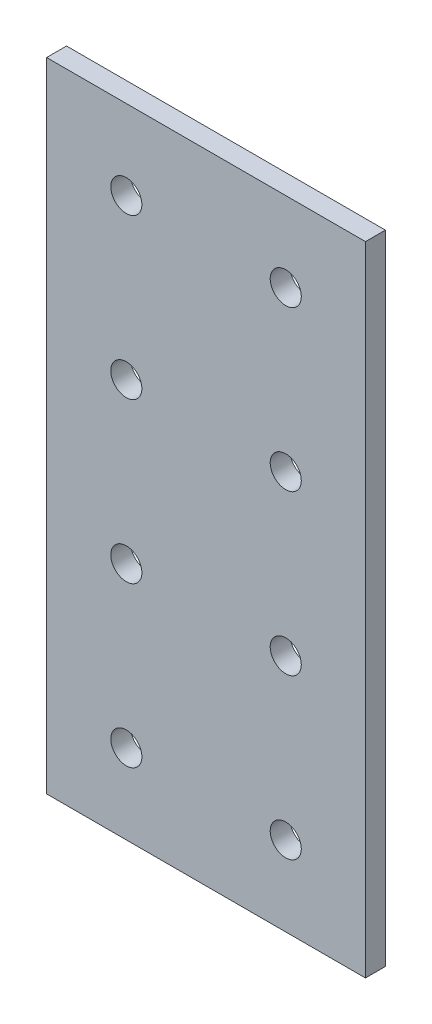
ISO-10303-21;
HEADER;
FILE_DESCRIPTION(('STEP AP214'),'2;1');
FILE_NAME('part.step','',(''),(''),'','','');
FILE_SCHEMA(('AUTOMOTIVE_DESIGN { 1 0 10303 214 1 1 1 1 }'));
ENDSEC;
DATA;
#1=APPLICATION_CONTEXT('core data for automotive mechanical design processes');
#2=APPLICATION_PROTOCOL_DEFINITION('international standard','automotive_design',2000,#1);
#3=PRODUCT_CONTEXT('',#1,'mechanical');
#4=PRODUCT('Part','Part','',(#3));
#5=PRODUCT_RELATED_PRODUCT_CATEGORY('part','',(#4));
#6=PRODUCT_DEFINITION_FORMATION('','',#4);
#7=PRODUCT_DEFINITION_CONTEXT('part definition',#1,'design');
#8=PRODUCT_DEFINITION('design','',#6,#7);
#9=PRODUCT_DEFINITION_SHAPE('','',#8);
#10=(LENGTH_UNIT() NAMED_UNIT(*) SI_UNIT(.MILLI.,.METRE.));
#11=(NAMED_UNIT(*) PLANE_ANGLE_UNIT() SI_UNIT($,.RADIAN.));
#12=(NAMED_UNIT(*) SI_UNIT($,.STERADIAN.) SOLID_ANGLE_UNIT());
#13=UNCERTAINTY_MEASURE_WITH_UNIT(LENGTH_MEASURE(1.E-05),#10,'distance_accuracy_value','');
#14=(GEOMETRIC_REPRESENTATION_CONTEXT(3) GLOBAL_UNCERTAINTY_ASSIGNED_CONTEXT((#13)) GLOBAL_UNIT_ASSIGNED_CONTEXT((#10,
#11,#12)) REPRESENTATION_CONTEXT('',''));
#15=CARTESIAN_POINT('',(0.,0.,0.));
#16=DIRECTION('',(0.,0.,1.));
#17=DIRECTION('',(1.,0.,0.));
#18=AXIS2_PLACEMENT_3D('',#15,#16,#17);
#19=CARTESIAN_POINT('',(0.,0.,3.175));
#20=DIRECTION('',(0.,0.,-1.));
#21=DIRECTION('',(-1.,0.,0.));
#22=AXIS2_PLACEMENT_3D('',#19,#20,#21);
#23=PLANE('',#22);
#24=DIRECTION('',(1.,0.,0.));
#25=VECTOR('',#24,1.);
#26=CARTESIAN_POINT('',(-25.4,0.,3.175));
#27=LINE('',#26,#25);
#28=CARTESIAN_POINT('',(-25.4,0.,3.175));
#29=VERTEX_POINT('',#28);
#30=CARTESIAN_POINT('',(25.4,0.,3.175));
#31=VERTEX_POINT('',#30);
#32=EDGE_CURVE('E75',#29,#31,#27,.T.);
#33=ORIENTED_EDGE('',*,*,#32,.T.);
#34=DIRECTION('',(0.,1.,0.));
#35=VECTOR('',#34,1.);
#36=CARTESIAN_POINT('',(25.4,50.8,3.175));
#37=LINE('',#36,#35);
#38=CARTESIAN_POINT('',(25.4,101.6,3.175));
#39=VERTEX_POINT('',#38);
#40=EDGE_CURVE('E78',#31,#39,#37,.T.);
#41=ORIENTED_EDGE('',*,*,#40,.T.);
#42=DIRECTION('',(-1.,0.,0.));
#43=VECTOR('',#42,1.);
#44=CARTESIAN_POINT('',(25.4,101.6,3.175));
#45=LINE('',#44,#43);
#46=CARTESIAN_POINT('',(-25.4,101.6,3.175));
#47=VERTEX_POINT('',#46);
#48=EDGE_CURVE('E82',#39,#47,#45,.T.);
#49=ORIENTED_EDGE('',*,*,#48,.T.);
#50=DIRECTION('',(0.,-1.,0.));
#51=VECTOR('',#50,1.);
#52=CARTESIAN_POINT('',(-25.4,101.6,3.175));
#53=LINE('',#52,#51);
#54=EDGE_CURVE('E50',#47,#29,#53,.T.);
#55=ORIENTED_EDGE('',*,*,#54,.T.);
#56=EDGE_LOOP('',(#33,#41,#49,#55));
#57=FACE_BOUND('',#56,.T.);
#58=CARTESIAN_POINT('',(-12.7,88.8999999999999,3.175));
#59=DIRECTION('',(0.,0.,1.));
#60=DIRECTION('',(1.,0.,0.));
#61=AXIS2_PLACEMENT_3D('',#58,#59,#60);
#62=CIRCLE('',#61,2.4765);
#63=CARTESIAN_POINT('',(-10.2235,88.8999999999999,3.175));
#64=VERTEX_POINT('',#63);
#65=EDGE_CURVE('E99',#64,#64,#62,.T.);
#66=ORIENTED_EDGE('',*,*,#65,.F.);
#67=EDGE_LOOP('',(#66));
#68=FACE_BOUND('',#67,.T.);
#69=CARTESIAN_POINT('',(12.7,88.8999999999999,3.175));
#70=DIRECTION('',(0.,0.,1.));
#71=DIRECTION('',(1.,0.,0.));
#72=AXIS2_PLACEMENT_3D('',#69,#70,#71);
#73=CIRCLE('',#72,2.4765);
#74=CARTESIAN_POINT('',(15.1765,88.8999999999999,3.175));
#75=VERTEX_POINT('',#74);
#76=EDGE_CURVE('E113',#75,#75,#73,.T.);
#77=ORIENTED_EDGE('',*,*,#76,.F.);
#78=EDGE_LOOP('',(#77));
#79=FACE_BOUND('',#78,.T.);
#80=CARTESIAN_POINT('',(-12.7,63.4999999999999,3.175));
#81=DIRECTION('',(0.,0.,1.));
#82=DIRECTION('',(1.,0.,0.));
#83=AXIS2_PLACEMENT_3D('',#80,#81,#82);
#84=CIRCLE('',#83,2.4765);
#85=CARTESIAN_POINT('',(-10.2235,63.4999999999999,3.175));
#86=VERTEX_POINT('',#85);
#87=EDGE_CURVE('E119',#86,#86,#84,.T.);
#88=ORIENTED_EDGE('',*,*,#87,.F.);
#89=EDGE_LOOP('',(#88));
#90=FACE_BOUND('',#89,.T.);
#91=CARTESIAN_POINT('',(12.7,63.4999999999999,3.175));
#92=DIRECTION('',(0.,0.,1.));
#93=DIRECTION('',(1.,0.,0.));
#94=AXIS2_PLACEMENT_3D('',#91,#92,#93);
#95=CIRCLE('',#94,2.4765);
#96=CARTESIAN_POINT('',(15.1765,63.4999999999999,3.175));
#97=VERTEX_POINT('',#96);
#98=EDGE_CURVE('E125',#97,#97,#95,.T.);
#99=ORIENTED_EDGE('',*,*,#98,.F.);
#100=EDGE_LOOP('',(#99));
#101=FACE_BOUND('',#100,.T.);
#102=CARTESIAN_POINT('',(12.7,12.7,3.175));
#103=DIRECTION('',(0.,0.,1.));
#104=DIRECTION('',(1.,0.,0.));
#105=AXIS2_PLACEMENT_3D('',#102,#103,#104);
#106=CIRCLE('',#105,2.4765);
#107=CARTESIAN_POINT('',(15.1765,12.7,3.175));
#108=VERTEX_POINT('',#107);
#109=EDGE_CURVE('E131',#108,#108,#106,.T.);
#110=ORIENTED_EDGE('',*,*,#109,.F.);
#111=EDGE_LOOP('',(#110));
#112=FACE_BOUND('',#111,.T.);
#113=CARTESIAN_POINT('',(-12.7,12.7,3.175));
#114=DIRECTION('',(0.,0.,1.));
#115=DIRECTION('',(1.,0.,0.));
#116=AXIS2_PLACEMENT_3D('',#113,#114,#115);
#117=CIRCLE('',#116,2.4765);
#118=CARTESIAN_POINT('',(-10.2235,12.7,3.175));
#119=VERTEX_POINT('',#118);
#120=EDGE_CURVE('E137',#119,#119,#117,.T.);
#121=ORIENTED_EDGE('',*,*,#120,.F.);
#122=EDGE_LOOP('',(#121));
#123=FACE_BOUND('',#122,.T.);
#124=CARTESIAN_POINT('',(-12.7,38.1,3.175));
#125=DIRECTION('',(0.,0.,1.));
#126=DIRECTION('',(1.,0.,0.));
#127=AXIS2_PLACEMENT_3D('',#124,#125,#126);
#128=CIRCLE('',#127,2.4765);
#129=CARTESIAN_POINT('',(-10.2235,38.1,3.175));
#130=VERTEX_POINT('',#129);
#131=EDGE_CURVE('E143',#130,#130,#128,.T.);
#132=ORIENTED_EDGE('',*,*,#131,.F.);
#133=EDGE_LOOP('',(#132));
#134=FACE_BOUND('',#133,.T.);
#135=CARTESIAN_POINT('',(12.7,38.1,3.175));
#136=DIRECTION('',(0.,0.,1.));
#137=DIRECTION('',(1.,0.,0.));
#138=AXIS2_PLACEMENT_3D('',#135,#136,#137);
#139=CIRCLE('',#138,2.4765);
#140=CARTESIAN_POINT('',(15.1765,38.1,3.175));
#141=VERTEX_POINT('',#140);
#142=EDGE_CURVE('E149',#141,#141,#139,.T.);
#143=ORIENTED_EDGE('',*,*,#142,.F.);
#144=EDGE_LOOP('',(#143));
#145=FACE_BOUND('',#144,.T.);
#146=ADVANCED_FACE('F33',(#57,#68,#79,#90,#101,#112,#123,#134,#145),#23,.F.);
#147=CARTESIAN_POINT('',(0.,0.,0.));
#148=DIRECTION('',(0.,0.,-1.));
#149=DIRECTION('',(-1.,0.,0.));
#150=AXIS2_PLACEMENT_3D('',#147,#148,#149);
#151=PLANE('',#150);
#152=CARTESIAN_POINT('',(-12.7,38.1,0.));
#153=DIRECTION('',(0.,0.,1.));
#154=DIRECTION('',(1.,0.,0.));
#155=AXIS2_PLACEMENT_3D('',#152,#153,#154);
#156=CIRCLE('',#155,2.4765);
#157=CARTESIAN_POINT('',(-10.2235,38.1,0.));
#158=VERTEX_POINT('',#157);
#159=EDGE_CURVE('E146',#158,#158,#156,.T.);
#160=ORIENTED_EDGE('',*,*,#159,.T.);
#161=EDGE_LOOP('',(#160));
#162=FACE_BOUND('',#161,.T.);
#163=CARTESIAN_POINT('',(12.7,12.7,0.));
#164=DIRECTION('',(0.,0.,1.));
#165=DIRECTION('',(1.,0.,0.));
#166=AXIS2_PLACEMENT_3D('',#163,#164,#165);
#167=CIRCLE('',#166,2.4765);
#168=CARTESIAN_POINT('',(15.1765,12.7,0.));
#169=VERTEX_POINT('',#168);
#170=EDGE_CURVE('E134',#169,#169,#167,.T.);
#171=ORIENTED_EDGE('',*,*,#170,.T.);
#172=EDGE_LOOP('',(#171));
#173=FACE_BOUND('',#172,.T.);
#174=CARTESIAN_POINT('',(-12.7,63.4999999999999,0.));
#175=DIRECTION('',(0.,0.,1.));
#176=DIRECTION('',(1.,0.,0.));
#177=AXIS2_PLACEMENT_3D('',#174,#175,#176);
#178=CIRCLE('',#177,2.4765);
#179=CARTESIAN_POINT('',(-10.2235,63.4999999999999,0.));
#180=VERTEX_POINT('',#179);
#181=EDGE_CURVE('E122',#180,#180,#178,.T.);
#182=ORIENTED_EDGE('',*,*,#181,.T.);
#183=EDGE_LOOP('',(#182));
#184=FACE_BOUND('',#183,.T.);
#185=CARTESIAN_POINT('',(-12.7,88.8999999999999,0.));
#186=DIRECTION('',(0.,0.,1.));
#187=DIRECTION('',(1.,0.,0.));
#188=AXIS2_PLACEMENT_3D('',#185,#186,#187);
#189=CIRCLE('',#188,2.4765);
#190=CARTESIAN_POINT('',(-10.2235,88.8999999999999,0.));
#191=VERTEX_POINT('',#190);
#192=EDGE_CURVE('E110',#191,#191,#189,.T.);
#193=ORIENTED_EDGE('',*,*,#192,.T.);
#194=EDGE_LOOP('',(#193));
#195=FACE_BOUND('',#194,.T.);
#196=DIRECTION('',(1.,0.,0.));
#197=VECTOR('',#196,1.);
#198=CARTESIAN_POINT('',(0.,0.,0.));
#199=LINE('',#198,#197);
#200=CARTESIAN_POINT('',(-25.4,0.,0.));
#201=VERTEX_POINT('',#200);
#202=CARTESIAN_POINT('',(25.4,0.,0.));
#203=VERTEX_POINT('',#202);
#204=EDGE_CURVE('E71',#201,#203,#199,.T.);
#205=ORIENTED_EDGE('',*,*,#204,.F.);
#206=DIRECTION('',(0.,-1.,0.));
#207=VECTOR('',#206,1.);
#208=CARTESIAN_POINT('',(-25.4,50.8,0.));
#209=LINE('',#208,#207);
#210=CARTESIAN_POINT('',(-25.4,101.6,0.));
#211=VERTEX_POINT('',#210);
#212=EDGE_CURVE('E67',#211,#201,#209,.T.);
#213=ORIENTED_EDGE('',*,*,#212,.F.);
#214=DIRECTION('',(-1.,0.,0.));
#215=VECTOR('',#214,1.);
#216=CARTESIAN_POINT('',(25.4,101.6,0.));
#217=LINE('',#216,#215);
#218=CARTESIAN_POINT('',(25.4,101.6,0.));
#219=VERTEX_POINT('',#218);
#220=EDGE_CURVE('E101',#219,#211,#217,.T.);
#221=ORIENTED_EDGE('',*,*,#220,.F.);
#222=DIRECTION('',(0.,1.,0.));
#223=VECTOR('',#222,1.);
#224=CARTESIAN_POINT('',(25.4,50.8,0.));
#225=LINE('',#224,#223);
#226=EDGE_CURVE('E88',#203,#219,#225,.T.);
#227=ORIENTED_EDGE('',*,*,#226,.F.);
#228=EDGE_LOOP('',(#205,#213,#221,#227));
#229=FACE_BOUND('',#228,.T.);
#230=CARTESIAN_POINT('',(12.7,88.8999999999999,0.));
#231=DIRECTION('',(0.,0.,1.));
#232=DIRECTION('',(1.,0.,0.));
#233=AXIS2_PLACEMENT_3D('',#230,#231,#232);
#234=CIRCLE('',#233,2.4765);
#235=CARTESIAN_POINT('',(15.1765,88.8999999999999,0.));
#236=VERTEX_POINT('',#235);
#237=EDGE_CURVE('E116',#236,#236,#234,.T.);
#238=ORIENTED_EDGE('',*,*,#237,.T.);
#239=EDGE_LOOP('',(#238));
#240=FACE_BOUND('',#239,.T.);
#241=CARTESIAN_POINT('',(12.7,63.4999999999999,0.));
#242=DIRECTION('',(0.,0.,1.));
#243=DIRECTION('',(1.,0.,0.));
#244=AXIS2_PLACEMENT_3D('',#241,#242,#243);
#245=CIRCLE('',#244,2.4765);
#246=CARTESIAN_POINT('',(15.1765,63.4999999999999,0.));
#247=VERTEX_POINT('',#246);
#248=EDGE_CURVE('E128',#247,#247,#245,.T.);
#249=ORIENTED_EDGE('',*,*,#248,.T.);
#250=EDGE_LOOP('',(#249));
#251=FACE_BOUND('',#250,.T.);
#252=CARTESIAN_POINT('',(-12.7,12.7,0.));
#253=DIRECTION('',(0.,0.,1.));
#254=DIRECTION('',(1.,0.,0.));
#255=AXIS2_PLACEMENT_3D('',#252,#253,#254);
#256=CIRCLE('',#255,2.4765);
#257=CARTESIAN_POINT('',(-10.2235,12.7,0.));
#258=VERTEX_POINT('',#257);
#259=EDGE_CURVE('E140',#258,#258,#256,.T.);
#260=ORIENTED_EDGE('',*,*,#259,.T.);
#261=EDGE_LOOP('',(#260));
#262=FACE_BOUND('',#261,.T.);
#263=CARTESIAN_POINT('',(12.7,38.1,0.));
#264=DIRECTION('',(0.,0.,1.));
#265=DIRECTION('',(1.,0.,0.));
#266=AXIS2_PLACEMENT_3D('',#263,#264,#265);
#267=CIRCLE('',#266,2.4765);
#268=CARTESIAN_POINT('',(15.1765,38.1,0.));
#269=VERTEX_POINT('',#268);
#270=EDGE_CURVE('E152',#269,#269,#267,.T.);
#271=ORIENTED_EDGE('',*,*,#270,.T.);
#272=EDGE_LOOP('',(#271));
#273=FACE_BOUND('',#272,.T.);
#274=ADVANCED_FACE('F162',(#162,#173,#184,#195,#229,#240,#251,#262,#273),#151,.T.);
#275=CARTESIAN_POINT('',(0.,0.,3.175));
#276=DIRECTION('',(0.,1.,0.));
#277=DIRECTION('',(0.,0.,1.));
#278=AXIS2_PLACEMENT_3D('',#275,#276,#277);
#279=PLANE('',#278);
#280=ORIENTED_EDGE('',*,*,#204,.T.);
#281=DIRECTION('',(0.,0.,-1.));
#282=VECTOR('',#281,1.);
#283=CARTESIAN_POINT('',(25.4,0.,3.175));
#284=LINE('',#283,#282);
#285=EDGE_CURVE('E11',#31,#203,#284,.T.);
#286=ORIENTED_EDGE('',*,*,#285,.F.);
#287=ORIENTED_EDGE('',*,*,#32,.F.);
#288=DIRECTION('',(0.,0.,-1.));
#289=VECTOR('',#288,1.);
#290=CARTESIAN_POINT('',(-25.4,0.,3.175));
#291=LINE('',#290,#289);
#292=EDGE_CURVE('E94',#29,#201,#291,.T.);
#293=ORIENTED_EDGE('',*,*,#292,.T.);
#294=EDGE_LOOP('',(#280,#286,#287,#293));
#295=FACE_BOUND('',#294,.T.);
#296=ADVANCED_FACE('F35',(#295),#279,.F.);
#297=CARTESIAN_POINT('',(25.4,50.8,3.175));
#298=DIRECTION('',(-1.,0.,0.));
#299=DIRECTION('',(0.,0.,1.));
#300=AXIS2_PLACEMENT_3D('',#297,#298,#299);
#301=PLANE('',#300);
#302=ORIENTED_EDGE('',*,*,#226,.T.);
#303=DIRECTION('',(0.,0.,-1.));
#304=VECTOR('',#303,1.);
#305=CARTESIAN_POINT('',(25.4,101.6,3.175));
#306=LINE('',#305,#304);
#307=EDGE_CURVE('E42',#39,#219,#306,.T.);
#308=ORIENTED_EDGE('',*,*,#307,.F.);
#309=ORIENTED_EDGE('',*,*,#40,.F.);
#310=ORIENTED_EDGE('',*,*,#285,.T.);
#311=EDGE_LOOP('',(#302,#308,#309,#310));
#312=FACE_BOUND('',#311,.T.);
#313=ADVANCED_FACE('F87',(#312),#301,.F.);
#314=CARTESIAN_POINT('',(25.4,101.6,3.175));
#315=DIRECTION('',(0.,-1.,0.));
#316=DIRECTION('',(0.,0.,-1.));
#317=AXIS2_PLACEMENT_3D('',#314,#315,#316);
#318=PLANE('',#317);
#319=ORIENTED_EDGE('',*,*,#220,.T.);
#320=DIRECTION('',(0.,0.,-1.));
#321=VECTOR('',#320,1.);
#322=CARTESIAN_POINT('',(-25.4,101.6,3.175));
#323=LINE('',#322,#321);
#324=EDGE_CURVE('E90',#47,#211,#323,.T.);
#325=ORIENTED_EDGE('',*,*,#324,.F.);
#326=ORIENTED_EDGE('',*,*,#48,.F.);
#327=ORIENTED_EDGE('',*,*,#307,.T.);
#328=EDGE_LOOP('',(#319,#325,#326,#327));
#329=FACE_BOUND('',#328,.T.);
#330=ADVANCED_FACE('F91',(#329),#318,.F.);
#331=CARTESIAN_POINT('',(-25.4,50.8,3.175));
#332=DIRECTION('',(1.,0.,0.));
#333=DIRECTION('',(0.,0.,-1.));
#334=AXIS2_PLACEMENT_3D('',#331,#332,#333);
#335=PLANE('',#334);
#336=ORIENTED_EDGE('',*,*,#212,.T.);
#337=ORIENTED_EDGE('',*,*,#292,.F.);
#338=ORIENTED_EDGE('',*,*,#54,.F.);
#339=ORIENTED_EDGE('',*,*,#324,.T.);
#340=EDGE_LOOP('',(#336,#337,#338,#339));
#341=FACE_BOUND('',#340,.T.);
#342=ADVANCED_FACE('F107',(#341),#335,.F.);
#343=CARTESIAN_POINT('',(-12.7,88.8999999999999,3.175));
#344=DIRECTION('',(0.,0.,-1.));
#345=DIRECTION('',(-1.,0.,0.));
#346=AXIS2_PLACEMENT_3D('',#343,#344,#345);
#347=CYLINDRICAL_SURFACE('',#346,2.4765);
#348=ORIENTED_EDGE('',*,*,#65,.T.);
#349=EDGE_LOOP('',(#348));
#350=FACE_BOUND('',#349,.T.);
#351=ORIENTED_EDGE('',*,*,#192,.F.);
#352=EDGE_LOOP('',(#351));
#353=FACE_BOUND('',#352,.T.);
#354=ADVANCED_FACE('F170',(#350,#353),#347,.F.);
#355=CARTESIAN_POINT('',(12.7,88.8999999999999,3.175));
#356=DIRECTION('',(0.,0.,-1.));
#357=DIRECTION('',(-1.,0.,0.));
#358=AXIS2_PLACEMENT_3D('',#355,#356,#357);
#359=CYLINDRICAL_SURFACE('',#358,2.4765);
#360=ORIENTED_EDGE('',*,*,#76,.T.);
#361=EDGE_LOOP('',(#360));
#362=FACE_BOUND('',#361,.T.);
#363=ORIENTED_EDGE('',*,*,#237,.F.);
#364=EDGE_LOOP('',(#363));
#365=FACE_BOUND('',#364,.T.);
#366=ADVANCED_FACE('F225',(#362,#365),#359,.F.);
#367=CARTESIAN_POINT('',(-12.7,63.4999999999999,3.175));
#368=DIRECTION('',(0.,0.,-1.));
#369=DIRECTION('',(-1.,0.,0.));
#370=AXIS2_PLACEMENT_3D('',#367,#368,#369);
#371=CYLINDRICAL_SURFACE('',#370,2.4765);
#372=ORIENTED_EDGE('',*,*,#87,.T.);
#373=EDGE_LOOP('',(#372));
#374=FACE_BOUND('',#373,.T.);
#375=ORIENTED_EDGE('',*,*,#181,.F.);
#376=EDGE_LOOP('',(#375));
#377=FACE_BOUND('',#376,.T.);
#378=ADVANCED_FACE('F233',(#374,#377),#371,.F.);
#379=CARTESIAN_POINT('',(12.7,63.4999999999999,3.175));
#380=DIRECTION('',(0.,0.,-1.));
#381=DIRECTION('',(-1.,0.,0.));
#382=AXIS2_PLACEMENT_3D('',#379,#380,#381);
#383=CYLINDRICAL_SURFACE('',#382,2.4765);
#384=ORIENTED_EDGE('',*,*,#98,.T.);
#385=EDGE_LOOP('',(#384));
#386=FACE_BOUND('',#385,.T.);
#387=ORIENTED_EDGE('',*,*,#248,.F.);
#388=EDGE_LOOP('',(#387));
#389=FACE_BOUND('',#388,.T.);
#390=ADVANCED_FACE('F241',(#386,#389),#383,.F.);
#391=CARTESIAN_POINT('',(12.7,12.7,3.175));
#392=DIRECTION('',(0.,0.,-1.));
#393=DIRECTION('',(-1.,0.,0.));
#394=AXIS2_PLACEMENT_3D('',#391,#392,#393);
#395=CYLINDRICAL_SURFACE('',#394,2.4765);
#396=ORIENTED_EDGE('',*,*,#109,.T.);
#397=EDGE_LOOP('',(#396));
#398=FACE_BOUND('',#397,.T.);
#399=ORIENTED_EDGE('',*,*,#170,.F.);
#400=EDGE_LOOP('',(#399));
#401=FACE_BOUND('',#400,.T.);
#402=ADVANCED_FACE('F250',(#398,#401),#395,.F.);
#403=CARTESIAN_POINT('',(-12.7,12.7,3.175));
#404=DIRECTION('',(0.,0.,-1.));
#405=DIRECTION('',(-1.,0.,0.));
#406=AXIS2_PLACEMENT_3D('',#403,#404,#405);
#407=CYLINDRICAL_SURFACE('',#406,2.4765);
#408=ORIENTED_EDGE('',*,*,#120,.T.);
#409=EDGE_LOOP('',(#408));
#410=FACE_BOUND('',#409,.T.);
#411=ORIENTED_EDGE('',*,*,#259,.F.);
#412=EDGE_LOOP('',(#411));
#413=FACE_BOUND('',#412,.T.);
#414=ADVANCED_FACE('F259',(#410,#413),#407,.F.);
#415=CARTESIAN_POINT('',(-12.7,38.1,3.175));
#416=DIRECTION('',(0.,0.,-1.));
#417=DIRECTION('',(-1.,0.,0.));
#418=AXIS2_PLACEMENT_3D('',#415,#416,#417);
#419=CYLINDRICAL_SURFACE('',#418,2.4765);
#420=ORIENTED_EDGE('',*,*,#131,.T.);
#421=EDGE_LOOP('',(#420));
#422=FACE_BOUND('',#421,.T.);
#423=ORIENTED_EDGE('',*,*,#159,.F.);
#424=EDGE_LOOP('',(#423));
#425=FACE_BOUND('',#424,.T.);
#426=ADVANCED_FACE('F268',(#422,#425),#419,.F.);
#427=CARTESIAN_POINT('',(12.7,38.1,3.175));
#428=DIRECTION('',(0.,0.,-1.));
#429=DIRECTION('',(-1.,0.,0.));
#430=AXIS2_PLACEMENT_3D('',#427,#428,#429);
#431=CYLINDRICAL_SURFACE('',#430,2.4765);
#432=ORIENTED_EDGE('',*,*,#142,.T.);
#433=EDGE_LOOP('',(#432));
#434=FACE_BOUND('',#433,.T.);
#435=ORIENTED_EDGE('',*,*,#270,.F.);
#436=EDGE_LOOP('',(#435));
#437=FACE_BOUND('',#436,.T.);
#438=ADVANCED_FACE('F158',(#434,#437),#431,.F.);
#439=CLOSED_SHELL('',(#146,#274,#296,#313,#330,#342,#354,#366,#378,#390,#402,#414,#426,#438));
#440=MANIFOLD_SOLID_BREP('B2',#439);
#441=ADVANCED_BREP_SHAPE_REPRESENTATION('',(#18,#440),#14);
#442=SHAPE_DEFINITION_REPRESENTATION(#9,#441);
ENDSEC;
END-ISO-10303-21;
